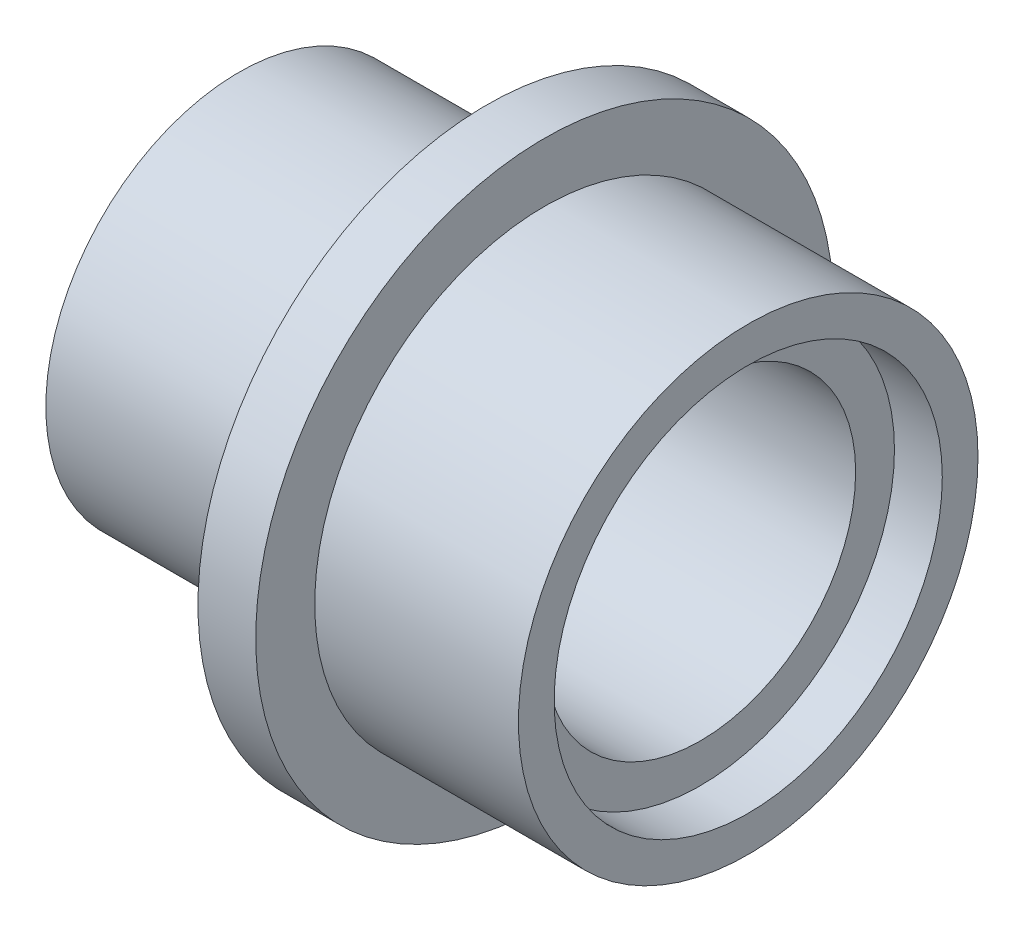
ISO-10303-21;
HEADER;
FILE_DESCRIPTION(('STEP AP214'),'2;1');
FILE_NAME('part.step','',(''),(''),'','','');
FILE_SCHEMA(('AUTOMOTIVE_DESIGN { 1 0 10303 214 1 1 1 1 }'));
ENDSEC;
DATA;
#1=APPLICATION_CONTEXT('core data for automotive mechanical design processes');
#2=APPLICATION_PROTOCOL_DEFINITION('international standard','automotive_design',2000,#1);
#3=PRODUCT_CONTEXT('',#1,'mechanical');
#4=PRODUCT('Part','Part','',(#3));
#5=PRODUCT_RELATED_PRODUCT_CATEGORY('part','',(#4));
#6=PRODUCT_DEFINITION_FORMATION('','',#4);
#7=PRODUCT_DEFINITION_CONTEXT('part definition',#1,'design');
#8=PRODUCT_DEFINITION('design','',#6,#7);
#9=PRODUCT_DEFINITION_SHAPE('','',#8);
#10=(LENGTH_UNIT() NAMED_UNIT(*) SI_UNIT(.MILLI.,.METRE.));
#11=(NAMED_UNIT(*) PLANE_ANGLE_UNIT() SI_UNIT($,.RADIAN.));
#12=(NAMED_UNIT(*) SI_UNIT($,.STERADIAN.) SOLID_ANGLE_UNIT());
#13=UNCERTAINTY_MEASURE_WITH_UNIT(LENGTH_MEASURE(1.E-05),#10,'distance_accuracy_value','');
#14=(GEOMETRIC_REPRESENTATION_CONTEXT(3) GLOBAL_UNCERTAINTY_ASSIGNED_CONTEXT((#13)) GLOBAL_UNIT_ASSIGNED_CONTEXT((#10,
#11,#12)) REPRESENTATION_CONTEXT('',''));
#15=CARTESIAN_POINT('',(0.,0.,0.));
#16=DIRECTION('',(0.,0.,1.));
#17=DIRECTION('',(1.,0.,0.));
#18=AXIS2_PLACEMENT_3D('',#15,#16,#17);
#19=CARTESIAN_POINT('',(0.,0.,0.));
#20=DIRECTION('',(1.,0.,0.));
#21=DIRECTION('',(0.,0.,-1.));
#22=AXIS2_PLACEMENT_3D('',#19,#20,#21);
#23=CYLINDRICAL_SURFACE('',#22,9.398);
#24=CARTESIAN_POINT('',(20.828,0.,0.));
#25=DIRECTION('',(1.,0.,0.));
#26=DIRECTION('',(0.,0.,-1.));
#27=AXIS2_PLACEMENT_3D('',#24,#25,#26);
#28=CIRCLE('',#27,9.398);
#29=CARTESIAN_POINT('',(20.828,0.,-9.398));
#30=VERTEX_POINT('',#29);
#31=EDGE_CURVE('E30',#30,#30,#28,.T.);
#32=ORIENTED_EDGE('',*,*,#31,.F.);
#33=EDGE_LOOP('',(#32));
#34=FACE_BOUND('',#33,.T.);
#35=CARTESIAN_POINT('',(12.4968,0.,0.));
#36=DIRECTION('',(1.,0.,0.));
#37=DIRECTION('',(0.,0.,-1.));
#38=AXIS2_PLACEMENT_3D('',#35,#36,#37);
#39=CIRCLE('',#38,9.398);
#40=CARTESIAN_POINT('',(12.4968,0.,-9.398));
#41=VERTEX_POINT('',#40);
#42=EDGE_CURVE('E10',#41,#41,#39,.T.);
#43=ORIENTED_EDGE('',*,*,#42,.T.);
#44=EDGE_LOOP('',(#43));
#45=FACE_BOUND('',#44,.T.);
#46=ADVANCED_FACE('F14',(#34,#45),#23,.T.);
#47=CARTESIAN_POINT('',(0.,0.,0.));
#48=DIRECTION('',(1.,0.,0.));
#49=DIRECTION('',(0.,0.,-1.));
#50=AXIS2_PLACEMENT_3D('',#47,#48,#49);
#51=CYLINDRICAL_SURFACE('',#50,7.9375);
#52=CARTESIAN_POINT('',(20.828,0.,0.));
#53=DIRECTION('',(1.,0.,0.));
#54=DIRECTION('',(0.,0.,-1.));
#55=AXIS2_PLACEMENT_3D('',#52,#53,#54);
#56=CIRCLE('',#55,7.9375);
#57=CARTESIAN_POINT('',(20.828,0.,-7.9375));
#58=VERTEX_POINT('',#57);
#59=EDGE_CURVE('E22',#58,#58,#56,.T.);
#60=ORIENTED_EDGE('',*,*,#59,.T.);
#61=EDGE_LOOP('',(#60));
#62=FACE_BOUND('',#61,.T.);
#63=CARTESIAN_POINT('',(18.8722,0.,0.));
#64=DIRECTION('',(1.,0.,0.));
#65=DIRECTION('',(0.,0.,-1.));
#66=AXIS2_PLACEMENT_3D('',#63,#64,#65);
#67=CIRCLE('',#66,7.9375);
#68=CARTESIAN_POINT('',(18.8722,0.,-7.9375));
#69=VERTEX_POINT('',#68);
#70=EDGE_CURVE('E33',#69,#69,#67,.T.);
#71=ORIENTED_EDGE('',*,*,#70,.F.);
#72=EDGE_LOOP('',(#71));
#73=FACE_BOUND('',#72,.T.);
#74=ADVANCED_FACE('F77',(#62,#73),#51,.F.);
#75=CARTESIAN_POINT('',(0.,0.,0.));
#76=DIRECTION('',(1.,0.,0.));
#77=DIRECTION('',(0.,0.,-1.));
#78=AXIS2_PLACEMENT_3D('',#75,#76,#77);
#79=CYLINDRICAL_SURFACE('',#78,6.35);
#80=CARTESIAN_POINT('',(18.8722,0.,0.));
#81=DIRECTION('',(1.,0.,0.));
#82=DIRECTION('',(0.,0.,-1.));
#83=AXIS2_PLACEMENT_3D('',#80,#81,#82);
#84=CIRCLE('',#83,6.35);
#85=CARTESIAN_POINT('',(18.8722,0.,-6.35));
#86=VERTEX_POINT('',#85);
#87=EDGE_CURVE('E27',#86,#86,#84,.T.);
#88=ORIENTED_EDGE('',*,*,#87,.T.);
#89=EDGE_LOOP('',(#88));
#90=FACE_BOUND('',#89,.T.);
#91=CARTESIAN_POINT('',(1.3716,0.,0.));
#92=DIRECTION('',(1.,0.,0.));
#93=DIRECTION('',(0.,0.,-1.));
#94=AXIS2_PLACEMENT_3D('',#91,#92,#93);
#95=CIRCLE('',#94,6.35);
#96=CARTESIAN_POINT('',(1.3716,0.,-6.35));
#97=VERTEX_POINT('',#96);
#98=EDGE_CURVE('E35',#97,#97,#95,.T.);
#99=ORIENTED_EDGE('',*,*,#98,.F.);
#100=EDGE_LOOP('',(#99));
#101=FACE_BOUND('',#100,.T.);
#102=ADVANCED_FACE('F83',(#90,#101),#79,.F.);
#103=CARTESIAN_POINT('',(0.,0.,0.));
#104=DIRECTION('',(1.,0.,0.));
#105=DIRECTION('',(0.,0.,-1.));
#106=AXIS2_PLACEMENT_3D('',#103,#104,#105);
#107=CYLINDRICAL_SURFACE('',#106,2.54);
#108=CARTESIAN_POINT('',(1.3716,0.,0.));
#109=DIRECTION('',(1.,0.,0.));
#110=DIRECTION('',(0.,0.,-1.));
#111=AXIS2_PLACEMENT_3D('',#108,#109,#110);
#112=CIRCLE('',#111,2.54);
#113=CARTESIAN_POINT('',(1.3716,0.,-2.54));
#114=VERTEX_POINT('',#113);
#115=EDGE_CURVE('E42',#114,#114,#112,.T.);
#116=ORIENTED_EDGE('',*,*,#115,.T.);
#117=EDGE_LOOP('',(#116));
#118=FACE_BOUND('',#117,.T.);
#119=CARTESIAN_POINT('',(0.,0.,0.));
#120=DIRECTION('',(1.,0.,0.));
#121=DIRECTION('',(0.,0.,-1.));
#122=AXIS2_PLACEMENT_3D('',#119,#120,#121);
#123=CIRCLE('',#122,2.54);
#124=CARTESIAN_POINT('',(0.,0.,-2.54));
#125=VERTEX_POINT('',#124);
#126=EDGE_CURVE('E39',#125,#125,#123,.T.);
#127=ORIENTED_EDGE('',*,*,#126,.F.);
#128=EDGE_LOOP('',(#127));
#129=FACE_BOUND('',#128,.T.);
#130=ADVANCED_FACE('F73',(#118,#129),#107,.F.);
#131=CARTESIAN_POINT('',(0.,0.,0.));
#132=DIRECTION('',(1.,0.,0.));
#133=DIRECTION('',(0.,0.,-1.));
#134=AXIS2_PLACEMENT_3D('',#131,#132,#133);
#135=CYLINDRICAL_SURFACE('',#134,7.8994);
#136=CARTESIAN_POINT('',(10.1346,0.,0.));
#137=DIRECTION('',(1.,0.,0.));
#138=DIRECTION('',(0.,0.,-1.));
#139=AXIS2_PLACEMENT_3D('',#136,#137,#138);
#140=CIRCLE('',#139,7.8994);
#141=CARTESIAN_POINT('',(10.1346,0.,-7.8994));
#142=VERTEX_POINT('',#141);
#143=EDGE_CURVE('E45',#142,#142,#140,.T.);
#144=ORIENTED_EDGE('',*,*,#143,.F.);
#145=EDGE_LOOP('',(#144));
#146=FACE_BOUND('',#145,.T.);
#147=CARTESIAN_POINT('',(0.,0.,0.));
#148=DIRECTION('',(1.,0.,0.));
#149=DIRECTION('',(0.,0.,-1.));
#150=AXIS2_PLACEMENT_3D('',#147,#148,#149);
#151=CIRCLE('',#150,7.8994);
#152=CARTESIAN_POINT('',(0.,0.,-7.8994));
#153=VERTEX_POINT('',#152);
#154=EDGE_CURVE('E48',#153,#153,#151,.T.);
#155=ORIENTED_EDGE('',*,*,#154,.T.);
#156=EDGE_LOOP('',(#155));
#157=FACE_BOUND('',#156,.T.);
#158=ADVANCED_FACE('F64',(#146,#157),#135,.T.);
#159=CARTESIAN_POINT('',(0.,0.,0.));
#160=DIRECTION('',(1.,0.,0.));
#161=DIRECTION('',(0.,0.,-1.));
#162=AXIS2_PLACEMENT_3D('',#159,#160,#161);
#163=CYLINDRICAL_SURFACE('',#162,11.811);
#164=CARTESIAN_POINT('',(12.4968,0.,0.));
#165=DIRECTION('',(1.,0.,0.));
#166=DIRECTION('',(0.,0.,-1.));
#167=AXIS2_PLACEMENT_3D('',#164,#165,#166);
#168=CIRCLE('',#167,11.811);
#169=CARTESIAN_POINT('',(12.4968,0.,-11.811));
#170=VERTEX_POINT('',#169);
#171=EDGE_CURVE('E18',#170,#170,#168,.T.);
#172=ORIENTED_EDGE('',*,*,#171,.F.);
#173=EDGE_LOOP('',(#172));
#174=FACE_BOUND('',#173,.T.);
#175=CARTESIAN_POINT('',(10.1346,0.,0.));
#176=DIRECTION('',(1.,0.,0.));
#177=DIRECTION('',(0.,0.,-1.));
#178=AXIS2_PLACEMENT_3D('',#175,#176,#177);
#179=CIRCLE('',#178,11.811);
#180=CARTESIAN_POINT('',(10.1346,0.,-11.811));
#181=VERTEX_POINT('',#180);
#182=EDGE_CURVE('E51',#181,#181,#179,.T.);
#183=ORIENTED_EDGE('',*,*,#182,.T.);
#184=EDGE_LOOP('',(#183));
#185=FACE_BOUND('',#184,.T.);
#186=ADVANCED_FACE('F62',(#174,#185),#163,.T.);
#187=CARTESIAN_POINT('',(12.4968,9.398,0.));
#188=DIRECTION('',(1.,0.,0.));
#189=DIRECTION('',(0.,0.,-1.));
#190=AXIS2_PLACEMENT_3D('',#187,#188,#189);
#191=PLANE('',#190);
#192=ORIENTED_EDGE('',*,*,#171,.T.);
#193=EDGE_LOOP('',(#192));
#194=FACE_BOUND('',#193,.T.);
#195=ORIENTED_EDGE('',*,*,#42,.F.);
#196=EDGE_LOOP('',(#195));
#197=FACE_BOUND('',#196,.T.);
#198=ADVANCED_FACE('F59',(#194,#197),#191,.T.);
#199=CARTESIAN_POINT('',(10.1346,11.811,0.));
#200=DIRECTION('',(-1.,0.,0.));
#201=DIRECTION('',(0.,0.,1.));
#202=AXIS2_PLACEMENT_3D('',#199,#200,#201);
#203=PLANE('',#202);
#204=ORIENTED_EDGE('',*,*,#143,.T.);
#205=EDGE_LOOP('',(#204));
#206=FACE_BOUND('',#205,.T.);
#207=ORIENTED_EDGE('',*,*,#182,.F.);
#208=EDGE_LOOP('',(#207));
#209=FACE_BOUND('',#208,.T.);
#210=ADVANCED_FACE('F71',(#206,#209),#203,.T.);
#211=CARTESIAN_POINT('',(0.,7.8994,0.));
#212=DIRECTION('',(-1.,0.,0.));
#213=DIRECTION('',(0.,0.,1.));
#214=AXIS2_PLACEMENT_3D('',#211,#212,#213);
#215=PLANE('',#214);
#216=ORIENTED_EDGE('',*,*,#126,.T.);
#217=EDGE_LOOP('',(#216));
#218=FACE_BOUND('',#217,.T.);
#219=ORIENTED_EDGE('',*,*,#154,.F.);
#220=EDGE_LOOP('',(#219));
#221=FACE_BOUND('',#220,.T.);
#222=ADVANCED_FACE('F99',(#218,#221),#215,.T.);
#223=CARTESIAN_POINT('',(1.3716,2.54,0.));
#224=DIRECTION('',(1.,0.,0.));
#225=DIRECTION('',(0.,0.,-1.));
#226=AXIS2_PLACEMENT_3D('',#223,#224,#225);
#227=PLANE('',#226);
#228=ORIENTED_EDGE('',*,*,#98,.T.);
#229=EDGE_LOOP('',(#228));
#230=FACE_BOUND('',#229,.T.);
#231=ORIENTED_EDGE('',*,*,#115,.F.);
#232=EDGE_LOOP('',(#231));
#233=FACE_BOUND('',#232,.T.);
#234=ADVANCED_FACE('F102',(#230,#233),#227,.T.);
#235=CARTESIAN_POINT('',(18.8722,6.35,0.));
#236=DIRECTION('',(1.,0.,0.));
#237=DIRECTION('',(0.,0.,-1.));
#238=AXIS2_PLACEMENT_3D('',#235,#236,#237);
#239=PLANE('',#238);
#240=ORIENTED_EDGE('',*,*,#70,.T.);
#241=EDGE_LOOP('',(#240));
#242=FACE_BOUND('',#241,.T.);
#243=ORIENTED_EDGE('',*,*,#87,.F.);
#244=EDGE_LOOP('',(#243));
#245=FACE_BOUND('',#244,.T.);
#246=ADVANCED_FACE('F110',(#242,#245),#239,.T.);
#247=CARTESIAN_POINT('',(20.828,7.9375,0.));
#248=DIRECTION('',(1.,0.,0.));
#249=DIRECTION('',(0.,0.,-1.));
#250=AXIS2_PLACEMENT_3D('',#247,#248,#249);
#251=PLANE('',#250);
#252=ORIENTED_EDGE('',*,*,#31,.T.);
#253=EDGE_LOOP('',(#252));
#254=FACE_BOUND('',#253,.T.);
#255=ORIENTED_EDGE('',*,*,#59,.F.);
#256=EDGE_LOOP('',(#255));
#257=FACE_BOUND('',#256,.T.);
#258=ADVANCED_FACE('F16',(#254,#257),#251,.T.);
#259=CLOSED_SHELL('',(#46,#74,#102,#130,#158,#186,#198,#210,#222,#234,#246,#258));
#260=MANIFOLD_SOLID_BREP('B1',#259);
#261=ADVANCED_BREP_SHAPE_REPRESENTATION('',(#18,#260),#14);
#262=SHAPE_DEFINITION_REPRESENTATION(#9,#261);
ENDSEC;
END-ISO-10303-21;
